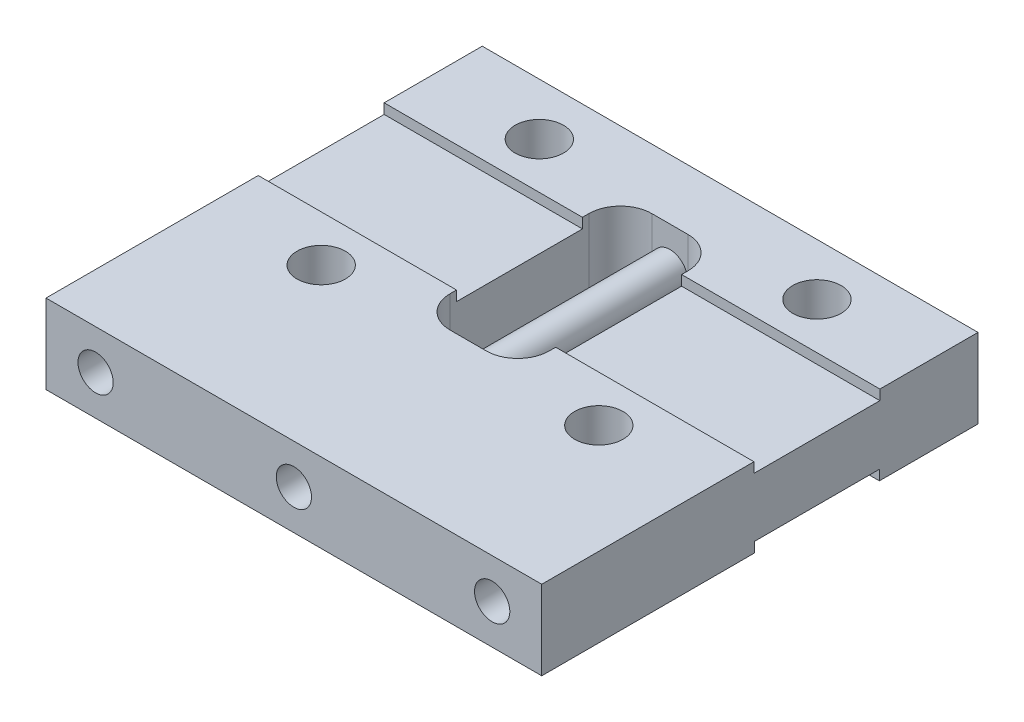
ISO-10303-21;
HEADER;
FILE_DESCRIPTION(('STEP AP214'),'2;1');
FILE_NAME('part.step','',(''),(''),'','','');
FILE_SCHEMA(('AUTOMOTIVE_DESIGN { 1 0 10303 214 1 1 1 1 }'));
ENDSEC;
DATA;
#1=APPLICATION_CONTEXT('core data for automotive mechanical design processes');
#2=APPLICATION_PROTOCOL_DEFINITION('international standard','automotive_design',2000,#1);
#3=PRODUCT_CONTEXT('',#1,'mechanical');
#4=PRODUCT('Part','Part','',(#3));
#5=PRODUCT_RELATED_PRODUCT_CATEGORY('part','',(#4));
#6=PRODUCT_DEFINITION_FORMATION('','',#4);
#7=PRODUCT_DEFINITION_CONTEXT('part definition',#1,'design');
#8=PRODUCT_DEFINITION('design','',#6,#7);
#9=PRODUCT_DEFINITION_SHAPE('','',#8);
#10=(LENGTH_UNIT() NAMED_UNIT(*) SI_UNIT(.MILLI.,.METRE.));
#11=(NAMED_UNIT(*) PLANE_ANGLE_UNIT() SI_UNIT($,.RADIAN.));
#12=(NAMED_UNIT(*) SI_UNIT($,.STERADIAN.) SOLID_ANGLE_UNIT());
#13=UNCERTAINTY_MEASURE_WITH_UNIT(LENGTH_MEASURE(1.E-05),#10,'distance_accuracy_value','');
#14=(GEOMETRIC_REPRESENTATION_CONTEXT(3) GLOBAL_UNCERTAINTY_ASSIGNED_CONTEXT((#13)) GLOBAL_UNIT_ASSIGNED_CONTEXT((#10,
#11,#12)) REPRESENTATION_CONTEXT('',''));
#15=CARTESIAN_POINT('',(0.,0.,0.));
#16=DIRECTION('',(0.,0.,1.));
#17=DIRECTION('',(1.,0.,0.));
#18=AXIS2_PLACEMENT_3D('',#15,#16,#17);
#19=CARTESIAN_POINT('',(22.5,2.,0.));
#20=DIRECTION('',(0.,0.,-1.));
#21=DIRECTION('',(-1.,0.,0.));
#22=AXIS2_PLACEMENT_3D('',#19,#20,#21);
#23=CYLINDRICAL_SURFACE('',#22,0.888999999999985);
#24=CARTESIAN_POINT('',(22.5,2.,22.));
#25=DIRECTION('',(0.,0.,-1.));
#26=DIRECTION('',(-1.,0.,0.));
#27=AXIS2_PLACEMENT_3D('',#24,#25,#26);
#28=CIRCLE('',#27,0.888999999999984);
#29=CARTESIAN_POINT('',(21.611,2.,22.));
#30=VERTEX_POINT('',#29);
#31=EDGE_CURVE('E651',#30,#30,#28,.T.);
#32=ORIENTED_EDGE('',*,*,#31,.F.);
#33=EDGE_LOOP('',(#32));
#34=FACE_BOUND('',#33,.T.);
#35=CARTESIAN_POINT('',(22.5,2.,16.));
#36=DIRECTION('',(0.,0.,-1.));
#37=DIRECTION('',(-1.,0.,0.));
#38=AXIS2_PLACEMENT_3D('',#35,#36,#37);
#39=CIRCLE('',#38,0.888999999999985);
#40=CARTESIAN_POINT('',(21.611,2.,16.));
#41=VERTEX_POINT('',#40);
#42=EDGE_CURVE('E11',#41,#41,#39,.F.);
#43=ORIENTED_EDGE('',*,*,#42,.F.);
#44=EDGE_LOOP('',(#43));
#45=FACE_BOUND('',#44,.T.);
#46=ADVANCED_FACE('F33',(#34,#45),#23,.F.);
#47=CARTESIAN_POINT('',(12.5,2.,22.));
#48=DIRECTION('',(0.,0.,1.));
#49=DIRECTION('',(1.,0.,0.));
#50=AXIS2_PLACEMENT_3D('',#47,#48,#49);
#51=CYLINDRICAL_SURFACE('',#50,0.888999999999987);
#52=CARTESIAN_POINT('',(12.5,2.,22.));
#53=DIRECTION('',(0.,0.,1.));
#54=DIRECTION('',(1.,0.,0.));
#55=AXIS2_PLACEMENT_3D('',#52,#53,#54);
#56=CIRCLE('',#55,0.888999999999989);
#57=CARTESIAN_POINT('',(13.389,2.,22.));
#58=VERTEX_POINT('',#57);
#59=EDGE_CURVE('E657',#58,#58,#56,.T.);
#60=ORIENTED_EDGE('',*,*,#59,.T.);
#61=EDGE_LOOP('',(#60));
#62=FACE_BOUND('',#61,.T.);
#63=CARTESIAN_POINT('',(12.5,2.,16.));
#64=DIRECTION('',(0.,0.,-1.));
#65=DIRECTION('',(-1.,0.,0.));
#66=AXIS2_PLACEMENT_3D('',#63,#64,#65);
#67=CIRCLE('',#66,0.888999999999987);
#68=CARTESIAN_POINT('',(11.611,2.,16.));
#69=VERTEX_POINT('',#68);
#70=EDGE_CURVE('E41',#69,#69,#67,.F.);
#71=ORIENTED_EDGE('',*,*,#70,.F.);
#72=EDGE_LOOP('',(#71));
#73=FACE_BOUND('',#72,.T.);
#74=ADVANCED_FACE('F324',(#62,#73),#51,.F.);
#75=CARTESIAN_POINT('',(2.5,2.,0.));
#76=DIRECTION('',(0.,0.,-1.));
#77=DIRECTION('',(-1.,0.,0.));
#78=AXIS2_PLACEMENT_3D('',#75,#76,#77);
#79=CYLINDRICAL_SURFACE('',#78,0.888999999999986);
#80=CARTESIAN_POINT('',(2.5,2.,22.));
#81=DIRECTION('',(0.,0.,-1.));
#82=DIRECTION('',(-1.,0.,0.));
#83=AXIS2_PLACEMENT_3D('',#80,#81,#82);
#84=CIRCLE('',#83,0.888999999999985);
#85=CARTESIAN_POINT('',(1.61100000000002,2.,22.));
#86=VERTEX_POINT('',#85);
#87=EDGE_CURVE('E654',#86,#86,#84,.T.);
#88=ORIENTED_EDGE('',*,*,#87,.F.);
#89=EDGE_LOOP('',(#88));
#90=FACE_BOUND('',#89,.T.);
#91=CARTESIAN_POINT('',(2.5,2.,16.));
#92=DIRECTION('',(0.,0.,-1.));
#93=DIRECTION('',(-1.,0.,0.));
#94=AXIS2_PLACEMENT_3D('',#91,#92,#93);
#95=CIRCLE('',#94,0.888999999999986);
#96=CARTESIAN_POINT('',(1.61100000000001,2.,16.));
#97=VERTEX_POINT('',#96);
#98=EDGE_CURVE('E317',#97,#97,#95,.F.);
#99=ORIENTED_EDGE('',*,*,#98,.F.);
#100=EDGE_LOOP('',(#99));
#101=FACE_BOUND('',#100,.T.);
#102=ADVANCED_FACE('F326',(#90,#101),#79,.F.);
#103=CARTESIAN_POINT('',(0.,4.,0.));
#104=DIRECTION('',(0.,-1.,0.));
#105=DIRECTION('',(0.,0.,-1.));
#106=AXIS2_PLACEMENT_3D('',#103,#104,#105);
#107=PLANE('',#106);
#108=CARTESIAN_POINT('',(19.5,4.,2.6225));
#109=DIRECTION('',(0.,-1.,0.));
#110=DIRECTION('',(0.,0.,-1.));
#111=AXIS2_PLACEMENT_3D('',#108,#109,#110);
#112=CIRCLE('',#111,1.21919999999999);
#113=CARTESIAN_POINT('',(19.5,4.,1.40330000000001));
#114=VERTEX_POINT('',#113);
#115=EDGE_CURVE('E639',#114,#114,#112,.T.);
#116=ORIENTED_EDGE('',*,*,#115,.T.);
#117=EDGE_LOOP('',(#116));
#118=FACE_BOUND('',#117,.T.);
#119=CARTESIAN_POINT('',(5.5,4.,2.6225));
#120=DIRECTION('',(0.,-1.,0.));
#121=DIRECTION('',(0.,0.,-1.));
#122=AXIS2_PLACEMENT_3D('',#119,#120,#121);
#123=CIRCLE('',#122,1.21919999999999);
#124=CARTESIAN_POINT('',(5.5,4.,1.40330000000001));
#125=VERTEX_POINT('',#124);
#126=EDGE_CURVE('E633',#125,#125,#123,.T.);
#127=ORIENTED_EDGE('',*,*,#126,.T.);
#128=EDGE_LOOP('',(#127));
#129=FACE_BOUND('',#128,.T.);
#130=DIRECTION('',(1.,0.,0.));
#131=VECTOR('',#130,1.);
#132=CARTESIAN_POINT('',(10.,4.,3.035));
#133=LINE('',#132,#131);
#134=CARTESIAN_POINT('',(11.5875,4.,3.035));
#135=VERTEX_POINT('',#134);
#136=CARTESIAN_POINT('',(13.4125,4.,3.035));
#137=VERTEX_POINT('',#136);
#138=EDGE_CURVE('E463',#135,#137,#133,.T.);
#139=ORIENTED_EDGE('',*,*,#138,.T.);
#140=CARTESIAN_POINT('',(13.4125,4.,4.6225));
#141=DIRECTION('',(0.,-1.,0.));
#142=DIRECTION('',(0.,0.,-1.));
#143=AXIS2_PLACEMENT_3D('',#140,#141,#142);
#144=CIRCLE('',#143,1.5875);
#145=CARTESIAN_POINT('',(15.,4.,4.6225));
#146=VERTEX_POINT('',#145);
#147=EDGE_CURVE('E312',#137,#146,#144,.T.);
#148=ORIENTED_EDGE('',*,*,#147,.T.);
#149=DIRECTION('',(0.,0.,1.));
#150=VECTOR('',#149,1.);
#151=CARTESIAN_POINT('',(15.,4.,3.035));
#152=LINE('',#151,#150);
#153=CARTESIAN_POINT('',(15.,4.,4.9475));
#154=VERTEX_POINT('',#153);
#155=EDGE_CURVE('E461',#146,#154,#152,.T.);
#156=ORIENTED_EDGE('',*,*,#155,.T.);
#157=DIRECTION('',(1.,0.,0.));
#158=VECTOR('',#157,1.);
#159=CARTESIAN_POINT('',(0.,4.,4.9475));
#160=LINE('',#159,#158);
#161=CARTESIAN_POINT('',(25.,4.,4.9475));
#162=VERTEX_POINT('',#161);
#163=EDGE_CURVE('E499',#154,#162,#160,.T.);
#164=ORIENTED_EDGE('',*,*,#163,.T.);
#165=DIRECTION('',(0.,0.,1.));
#166=VECTOR('',#165,1.);
#167=CARTESIAN_POINT('',(25.,4.,0.));
#168=LINE('',#167,#166);
#169=CARTESIAN_POINT('',(25.,4.,0.));
#170=VERTEX_POINT('',#169);
#171=EDGE_CURVE('E249',#170,#162,#168,.T.);
#172=ORIENTED_EDGE('',*,*,#171,.F.);
#173=DIRECTION('',(1.,0.,0.));
#174=VECTOR('',#173,1.);
#175=CARTESIAN_POINT('',(0.,4.,0.));
#176=LINE('',#175,#174);
#177=CARTESIAN_POINT('',(0.,4.,0.));
#178=VERTEX_POINT('',#177);
#179=EDGE_CURVE('E250',#178,#170,#176,.T.);
#180=ORIENTED_EDGE('',*,*,#179,.F.);
#181=DIRECTION('',(0.,0.,-1.));
#182=VECTOR('',#181,1.);
#183=CARTESIAN_POINT('',(0.,4.,22.));
#184=LINE('',#183,#182);
#185=CARTESIAN_POINT('',(0.,4.,4.9475));
#186=VERTEX_POINT('',#185);
#187=EDGE_CURVE('E274',#186,#178,#184,.T.);
#188=ORIENTED_EDGE('',*,*,#187,.F.);
#189=DIRECTION('',(1.,0.,0.));
#190=VECTOR('',#189,1.);
#191=CARTESIAN_POINT('',(0.,4.,4.9475));
#192=LINE('',#191,#190);
#193=CARTESIAN_POINT('',(10.,4.,4.9475));
#194=VERTEX_POINT('',#193);
#195=EDGE_CURVE('E569',#186,#194,#192,.T.);
#196=ORIENTED_EDGE('',*,*,#195,.T.);
#197=DIRECTION('',(0.,0.,-1.));
#198=VECTOR('',#197,1.);
#199=CARTESIAN_POINT('',(10.,4.,13.21));
#200=LINE('',#199,#198);
#201=CARTESIAN_POINT('',(10.,4.,4.6225));
#202=VERTEX_POINT('',#201);
#203=EDGE_CURVE('E563',#194,#202,#200,.T.);
#204=ORIENTED_EDGE('',*,*,#203,.T.);
#205=CARTESIAN_POINT('',(11.5875,4.,4.6225));
#206=DIRECTION('',(0.,-1.,0.));
#207=DIRECTION('',(0.,0.,-1.));
#208=AXIS2_PLACEMENT_3D('',#205,#206,#207);
#209=CIRCLE('',#208,1.5875);
#210=EDGE_CURVE('E55',#202,#135,#209,.T.);
#211=ORIENTED_EDGE('',*,*,#210,.T.);
#212=EDGE_LOOP('',(#139,#148,#156,#164,#172,#180,#188,#196,#204,#211));
#213=FACE_BOUND('',#212,.T.);
#214=ADVANCED_FACE('F333',(#118,#129,#213),#107,.F.);
#215=CARTESIAN_POINT('',(0.,0.,0.));
#216=DIRECTION('',(0.,-1.,0.));
#217=DIRECTION('',(0.,0.,-1.));
#218=AXIS2_PLACEMENT_3D('',#215,#216,#217);
#219=PLANE('',#218);
#220=CARTESIAN_POINT('',(19.5,0.,13.6225));
#221=DIRECTION('',(0.,-1.,0.));
#222=DIRECTION('',(0.,0.,-1.));
#223=AXIS2_PLACEMENT_3D('',#220,#221,#222);
#224=CIRCLE('',#223,1.21919999999999);
#225=CARTESIAN_POINT('',(19.5,0.,12.4033));
#226=VERTEX_POINT('',#225);
#227=EDGE_CURVE('E648',#226,#226,#224,.T.);
#228=ORIENTED_EDGE('',*,*,#227,.F.);
#229=EDGE_LOOP('',(#228));
#230=FACE_BOUND('',#229,.T.);
#231=CARTESIAN_POINT('',(5.5,0.,13.6225));
#232=DIRECTION('',(0.,-1.,0.));
#233=DIRECTION('',(0.,0.,-1.));
#234=AXIS2_PLACEMENT_3D('',#231,#232,#233);
#235=CIRCLE('',#234,1.21919999999999);
#236=CARTESIAN_POINT('',(5.5,0.,12.4033));
#237=VERTEX_POINT('',#236);
#238=EDGE_CURVE('E630',#237,#237,#235,.T.);
#239=ORIENTED_EDGE('',*,*,#238,.F.);
#240=EDGE_LOOP('',(#239));
#241=FACE_BOUND('',#240,.T.);
#242=DIRECTION('',(1.,0.,0.));
#243=VECTOR('',#242,1.);
#244=CARTESIAN_POINT('',(0.,0.,11.2725));
#245=LINE('',#244,#243);
#246=CARTESIAN_POINT('',(0.,0.,11.2725));
#247=VERTEX_POINT('',#246);
#248=CARTESIAN_POINT('',(10.,0.,11.2725));
#249=VERTEX_POINT('',#248);
#250=EDGE_CURVE('E518',#247,#249,#245,.T.);
#251=ORIENTED_EDGE('',*,*,#250,.T.);
#252=DIRECTION('',(0.,0.,-1.));
#253=VECTOR('',#252,1.);
#254=CARTESIAN_POINT('',(10.,0.,13.21));
#255=LINE('',#254,#253);
#256=CARTESIAN_POINT('',(10.,0.,11.6225));
#257=VERTEX_POINT('',#256);
#258=EDGE_CURVE('E479',#257,#249,#255,.T.);
#259=ORIENTED_EDGE('',*,*,#258,.F.);
#260=CARTESIAN_POINT('',(11.5875,0.,11.6225));
#261=DIRECTION('',(0.,-1.,0.));
#262=DIRECTION('',(0.,0.,-1.));
#263=AXIS2_PLACEMENT_3D('',#260,#261,#262);
#264=CIRCLE('',#263,1.5875);
#265=CARTESIAN_POINT('',(11.5875,0.,13.21));
#266=VERTEX_POINT('',#265);
#267=EDGE_CURVE('E306',#257,#266,#264,.F.);
#268=ORIENTED_EDGE('',*,*,#267,.T.);
#269=DIRECTION('',(-1.,0.,0.));
#270=VECTOR('',#269,1.);
#271=CARTESIAN_POINT('',(15.,0.,13.21));
#272=LINE('',#271,#270);
#273=CARTESIAN_POINT('',(13.4125,0.,13.21));
#274=VERTEX_POINT('',#273);
#275=EDGE_CURVE('E474',#274,#266,#272,.T.);
#276=ORIENTED_EDGE('',*,*,#275,.F.);
#277=CARTESIAN_POINT('',(13.4125,0.,11.6225));
#278=DIRECTION('',(0.,-1.,0.));
#279=DIRECTION('',(0.,0.,-1.));
#280=AXIS2_PLACEMENT_3D('',#277,#278,#279);
#281=CIRCLE('',#280,1.5875);
#282=CARTESIAN_POINT('',(15.,0.,11.6225));
#283=VERTEX_POINT('',#282);
#284=EDGE_CURVE('E302',#274,#283,#281,.F.);
#285=ORIENTED_EDGE('',*,*,#284,.T.);
#286=DIRECTION('',(0.,0.,1.));
#287=VECTOR('',#286,1.);
#288=CARTESIAN_POINT('',(15.,0.,3.035));
#289=LINE('',#288,#287);
#290=CARTESIAN_POINT('',(15.,0.,11.2725));
#291=VERTEX_POINT('',#290);
#292=EDGE_CURVE('E483',#291,#283,#289,.T.);
#293=ORIENTED_EDGE('',*,*,#292,.F.);
#294=DIRECTION('',(1.,0.,0.));
#295=VECTOR('',#294,1.);
#296=CARTESIAN_POINT('',(-0.001000000000001,0.,11.2725));
#297=LINE('',#296,#295);
#298=CARTESIAN_POINT('',(25.,0.,11.2725));
#299=VERTEX_POINT('',#298);
#300=EDGE_CURVE('E554',#291,#299,#297,.T.);
#301=ORIENTED_EDGE('',*,*,#300,.T.);
#302=DIRECTION('',(0.,0.,1.));
#303=VECTOR('',#302,1.);
#304=CARTESIAN_POINT('',(25.,0.,0.));
#305=LINE('',#304,#303);
#306=CARTESIAN_POINT('',(25.,0.,22.));
#307=VERTEX_POINT('',#306);
#308=EDGE_CURVE('E267',#299,#307,#305,.T.);
#309=ORIENTED_EDGE('',*,*,#308,.T.);
#310=DIRECTION('',(-1.,0.,0.));
#311=VECTOR('',#310,1.);
#312=CARTESIAN_POINT('',(25.,0.,22.));
#313=LINE('',#312,#311);
#314=CARTESIAN_POINT('',(0.,0.,22.));
#315=VERTEX_POINT('',#314);
#316=EDGE_CURVE('E271',#307,#315,#313,.T.);
#317=ORIENTED_EDGE('',*,*,#316,.T.);
#318=DIRECTION('',(0.,0.,-1.));
#319=VECTOR('',#318,1.);
#320=CARTESIAN_POINT('',(0.,0.,22.));
#321=LINE('',#320,#319);
#322=EDGE_CURVE('E260',#315,#247,#321,.T.);
#323=ORIENTED_EDGE('',*,*,#322,.T.);
#324=EDGE_LOOP('',(#251,#259,#268,#276,#285,#293,#301,#309,#317,#323));
#325=FACE_BOUND('',#324,.T.);
#326=ADVANCED_FACE('F430',(#230,#241,#325),#219,.T.);
#327=CARTESIAN_POINT('',(0.,4.,22.));
#328=DIRECTION('',(-1.,0.,0.));
#329=DIRECTION('',(0.,0.,1.));
#330=AXIS2_PLACEMENT_3D('',#327,#328,#329);
#331=PLANE('',#330);
#332=DIRECTION('',(0.,1.,0.));
#333=VECTOR('',#332,1.);
#334=CARTESIAN_POINT('',(0.,3.492,4.9475));
#335=LINE('',#334,#333);
#336=CARTESIAN_POINT('',(0.,3.492,4.9475));
#337=VERTEX_POINT('',#336);
#338=EDGE_CURVE('E495',#337,#186,#335,.T.);
#339=ORIENTED_EDGE('',*,*,#338,.T.);
#340=ORIENTED_EDGE('',*,*,#187,.T.);
#341=DIRECTION('',(0.,-1.,0.));
#342=VECTOR('',#341,1.);
#343=CARTESIAN_POINT('',(0.,4.,0.));
#344=LINE('',#343,#342);
#345=CARTESIAN_POINT('',(0.,0.,0.));
#346=VERTEX_POINT('',#345);
#347=EDGE_CURVE('E259',#178,#346,#344,.T.);
#348=ORIENTED_EDGE('',*,*,#347,.T.);
#349=CARTESIAN_POINT('',(0.,0.,4.9725));
#350=VERTEX_POINT('',#349);
#351=EDGE_CURVE('E264',#350,#346,#321,.T.);
#352=ORIENTED_EDGE('',*,*,#351,.F.);
#353=DIRECTION('',(0.,1.,0.));
#354=VECTOR('',#353,1.);
#355=CARTESIAN_POINT('',(0.,0.,4.9725));
#356=LINE('',#355,#354);
#357=CARTESIAN_POINT('',(0.,0.508,4.9725));
#358=VERTEX_POINT('',#357);
#359=EDGE_CURVE('E512',#350,#358,#356,.T.);
#360=ORIENTED_EDGE('',*,*,#359,.T.);
#361=DIRECTION('',(0.,0.,1.));
#362=VECTOR('',#361,1.);
#363=CARTESIAN_POINT('',(0.,0.508,4.9725));
#364=LINE('',#363,#362);
#365=CARTESIAN_POINT('',(0.,0.508,11.2725));
#366=VERTEX_POINT('',#365);
#367=EDGE_CURVE('E515',#358,#366,#364,.T.);
#368=ORIENTED_EDGE('',*,*,#367,.T.);
#369=DIRECTION('',(0.,-1.,0.));
#370=VECTOR('',#369,1.);
#371=CARTESIAN_POINT('',(0.,0.508,11.2725));
#372=LINE('',#371,#370);
#373=EDGE_CURVE('E516',#366,#247,#372,.T.);
#374=ORIENTED_EDGE('',*,*,#373,.T.);
#375=ORIENTED_EDGE('',*,*,#322,.F.);
#376=DIRECTION('',(0.,-1.,0.));
#377=VECTOR('',#376,1.);
#378=CARTESIAN_POINT('',(0.,4.,22.));
#379=LINE('',#378,#377);
#380=CARTESIAN_POINT('',(0.,4.,22.));
#381=VERTEX_POINT('',#380);
#382=EDGE_CURVE('E275',#381,#315,#379,.T.);
#383=ORIENTED_EDGE('',*,*,#382,.F.);
#384=CARTESIAN_POINT('',(0.,4.,11.2975));
#385=VERTEX_POINT('',#384);
#386=EDGE_CURVE('E254',#381,#385,#184,.T.);
#387=ORIENTED_EDGE('',*,*,#386,.T.);
#388=DIRECTION('',(0.,-1.,0.));
#389=VECTOR('',#388,1.);
#390=CARTESIAN_POINT('',(0.,4.,11.2975));
#391=LINE('',#390,#389);
#392=CARTESIAN_POINT('',(0.,3.492,11.2975));
#393=VERTEX_POINT('',#392);
#394=EDGE_CURVE('E615',#385,#393,#391,.T.);
#395=ORIENTED_EDGE('',*,*,#394,.T.);
#396=DIRECTION('',(0.,0.,-1.));
#397=VECTOR('',#396,1.);
#398=CARTESIAN_POINT('',(0.,3.492,11.2975));
#399=LINE('',#398,#397);
#400=EDGE_CURVE('E604',#393,#337,#399,.T.);
#401=ORIENTED_EDGE('',*,*,#400,.T.);
#402=EDGE_LOOP('',(#339,#340,#348,#352,#360,#368,#374,#375,#383,#387,#395,#401));
#403=FACE_BOUND('',#402,.T.);
#404=ADVANCED_FACE('F434',(#403),#331,.T.);
#405=CARTESIAN_POINT('',(25.,4.,22.));
#406=DIRECTION('',(0.,0.,1.));
#407=DIRECTION('',(1.,0.,0.));
#408=AXIS2_PLACEMENT_3D('',#405,#406,#407);
#409=PLANE('',#408);
#410=ORIENTED_EDGE('',*,*,#59,.F.);
#411=EDGE_LOOP('',(#410));
#412=FACE_BOUND('',#411,.T.);
#413=ORIENTED_EDGE('',*,*,#87,.T.);
#414=EDGE_LOOP('',(#413));
#415=FACE_BOUND('',#414,.T.);
#416=ORIENTED_EDGE('',*,*,#31,.T.);
#417=EDGE_LOOP('',(#416));
#418=FACE_BOUND('',#417,.T.);
#419=ORIENTED_EDGE('',*,*,#316,.F.);
#420=DIRECTION('',(0.,-1.,0.));
#421=VECTOR('',#420,1.);
#422=CARTESIAN_POINT('',(25.,4.,22.));
#423=LINE('',#422,#421);
#424=CARTESIAN_POINT('',(25.,4.,22.));
#425=VERTEX_POINT('',#424);
#426=EDGE_CURVE('E278',#425,#307,#423,.T.);
#427=ORIENTED_EDGE('',*,*,#426,.F.);
#428=DIRECTION('',(-1.,0.,0.));
#429=VECTOR('',#428,1.);
#430=CARTESIAN_POINT('',(25.,4.,22.));
#431=LINE('',#430,#429);
#432=EDGE_CURVE('E248',#425,#381,#431,.T.);
#433=ORIENTED_EDGE('',*,*,#432,.T.);
#434=ORIENTED_EDGE('',*,*,#382,.T.);
#435=EDGE_LOOP('',(#419,#427,#433,#434));
#436=FACE_BOUND('',#435,.T.);
#437=ADVANCED_FACE('F431',(#412,#415,#418,#436),#409,.T.);
#438=CARTESIAN_POINT('',(25.,4.,0.));
#439=DIRECTION('',(1.,0.,0.));
#440=DIRECTION('',(0.,0.,-1.));
#441=AXIS2_PLACEMENT_3D('',#438,#439,#440);
#442=PLANE('',#441);
#443=DIRECTION('',(0.,1.,0.));
#444=VECTOR('',#443,1.);
#445=CARTESIAN_POINT('',(25.,3.492,4.9475));
#446=LINE('',#445,#444);
#447=CARTESIAN_POINT('',(25.,3.492,4.9475));
#448=VERTEX_POINT('',#447);
#449=EDGE_CURVE('E232',#448,#162,#446,.T.);
#450=ORIENTED_EDGE('',*,*,#449,.F.);
#451=DIRECTION('',(0.,0.,-1.));
#452=VECTOR('',#451,1.);
#453=CARTESIAN_POINT('',(25.,3.492,11.2975));
#454=LINE('',#453,#452);
#455=CARTESIAN_POINT('',(25.,3.492,11.2975));
#456=VERTEX_POINT('',#455);
#457=EDGE_CURVE('E241',#456,#448,#454,.T.);
#458=ORIENTED_EDGE('',*,*,#457,.F.);
#459=DIRECTION('',(0.,-1.,0.));
#460=VECTOR('',#459,1.);
#461=CARTESIAN_POINT('',(25.,4.,11.2975));
#462=LINE('',#461,#460);
#463=CARTESIAN_POINT('',(25.,4.,11.2975));
#464=VERTEX_POINT('',#463);
#465=EDGE_CURVE('E223',#464,#456,#462,.T.);
#466=ORIENTED_EDGE('',*,*,#465,.F.);
#467=EDGE_CURVE('E238',#464,#425,#168,.T.);
#468=ORIENTED_EDGE('',*,*,#467,.T.);
#469=ORIENTED_EDGE('',*,*,#426,.T.);
#470=ORIENTED_EDGE('',*,*,#308,.F.);
#471=DIRECTION('',(0.,-1.,0.));
#472=VECTOR('',#471,1.);
#473=CARTESIAN_POINT('',(25.,0.508,11.2725));
#474=LINE('',#473,#472);
#475=CARTESIAN_POINT('',(25.,0.508,11.2725));
#476=VERTEX_POINT('',#475);
#477=EDGE_CURVE('E548',#476,#299,#474,.T.);
#478=ORIENTED_EDGE('',*,*,#477,.F.);
#479=DIRECTION('',(0.,0.,1.));
#480=VECTOR('',#479,1.);
#481=CARTESIAN_POINT('',(25.,0.508,4.9725));
#482=LINE('',#481,#480);
#483=CARTESIAN_POINT('',(25.,0.508,4.9725));
#484=VERTEX_POINT('',#483);
#485=EDGE_CURVE('E551',#484,#476,#482,.T.);
#486=ORIENTED_EDGE('',*,*,#485,.F.);
#487=DIRECTION('',(0.,1.,0.));
#488=VECTOR('',#487,1.);
#489=CARTESIAN_POINT('',(25.,0.,4.9725));
#490=LINE('',#489,#488);
#491=CARTESIAN_POINT('',(25.,0.,4.9725));
#492=VERTEX_POINT('',#491);
#493=EDGE_CURVE('E504',#492,#484,#490,.T.);
#494=ORIENTED_EDGE('',*,*,#493,.F.);
#495=CARTESIAN_POINT('',(25.,0.,0.));
#496=VERTEX_POINT('',#495);
#497=EDGE_CURVE('E268',#496,#492,#305,.T.);
#498=ORIENTED_EDGE('',*,*,#497,.F.);
#499=DIRECTION('',(0.,-1.,0.));
#500=VECTOR('',#499,1.);
#501=CARTESIAN_POINT('',(25.,4.,0.));
#502=LINE('',#501,#500);
#503=EDGE_CURVE('E280',#170,#496,#502,.T.);
#504=ORIENTED_EDGE('',*,*,#503,.F.);
#505=ORIENTED_EDGE('',*,*,#171,.T.);
#506=EDGE_LOOP('',(#450,#458,#466,#468,#469,#470,#478,#486,#494,#498,#504,#505));
#507=FACE_BOUND('',#506,.T.);
#508=ADVANCED_FACE('F236',(#507),#442,.T.);
#509=CARTESIAN_POINT('',(0.,4.,0.));
#510=DIRECTION('',(0.,0.,-1.));
#511=DIRECTION('',(-1.,0.,0.));
#512=AXIS2_PLACEMENT_3D('',#509,#510,#511);
#513=PLANE('',#512);
#514=DIRECTION('',(1.,0.,0.));
#515=VECTOR('',#514,1.);
#516=CARTESIAN_POINT('',(0.,0.,0.));
#517=LINE('',#516,#515);
#518=EDGE_CURVE('E263',#346,#496,#517,.T.);
#519=ORIENTED_EDGE('',*,*,#518,.F.);
#520=ORIENTED_EDGE('',*,*,#347,.F.);
#521=ORIENTED_EDGE('',*,*,#179,.T.);
#522=ORIENTED_EDGE('',*,*,#503,.T.);
#523=EDGE_LOOP('',(#519,#520,#521,#522));
#524=FACE_BOUND('',#523,.T.);
#525=ADVANCED_FACE('F425',(#524),#513,.T.);
#526=CARTESIAN_POINT('',(19.5,4.,13.6225));
#527=DIRECTION('',(0.,-1.,0.));
#528=DIRECTION('',(0.,0.,-1.));
#529=AXIS2_PLACEMENT_3D('',#526,#527,#528);
#530=CIRCLE('',#529,1.21919999999999);
#531=CARTESIAN_POINT('',(19.5,4.,12.4033));
#532=VERTEX_POINT('',#531);
#533=EDGE_CURVE('E645',#532,#532,#530,.T.);
#534=ORIENTED_EDGE('',*,*,#533,.T.);
#535=EDGE_LOOP('',(#534));
#536=FACE_BOUND('',#535,.T.);
#537=CARTESIAN_POINT('',(5.5,4.,13.6225));
#538=DIRECTION('',(0.,-1.,0.));
#539=DIRECTION('',(0.,0.,-1.));
#540=AXIS2_PLACEMENT_3D('',#537,#538,#539);
#541=CIRCLE('',#540,1.21919999999999);
#542=CARTESIAN_POINT('',(5.5,4.,12.4033));
#543=VERTEX_POINT('',#542);
#544=EDGE_CURVE('E242',#543,#543,#541,.T.);
#545=ORIENTED_EDGE('',*,*,#544,.T.);
#546=EDGE_LOOP('',(#545));
#547=FACE_BOUND('',#546,.T.);
#548=ORIENTED_EDGE('',*,*,#467,.F.);
#549=DIRECTION('',(1.,0.,0.));
#550=VECTOR('',#549,1.);
#551=CARTESIAN_POINT('',(0.,4.,11.2975));
#552=LINE('',#551,#550);
#553=CARTESIAN_POINT('',(15.,4.,11.2975));
#554=VERTEX_POINT('',#553);
#555=EDGE_CURVE('E220',#554,#464,#552,.T.);
#556=ORIENTED_EDGE('',*,*,#555,.F.);
#557=CARTESIAN_POINT('',(15.,4.,11.6225));
#558=VERTEX_POINT('',#557);
#559=EDGE_CURVE('E469',#554,#558,#152,.T.);
#560=ORIENTED_EDGE('',*,*,#559,.T.);
#561=CARTESIAN_POINT('',(13.4125,4.,11.6225));
#562=DIRECTION('',(0.,-1.,0.));
#563=DIRECTION('',(0.,0.,-1.));
#564=AXIS2_PLACEMENT_3D('',#561,#562,#563);
#565=CIRCLE('',#564,1.5875);
#566=CARTESIAN_POINT('',(13.4125,4.,13.21));
#567=VERTEX_POINT('',#566);
#568=EDGE_CURVE('E304',#558,#567,#565,.T.);
#569=ORIENTED_EDGE('',*,*,#568,.T.);
#570=DIRECTION('',(-1.,0.,0.));
#571=VECTOR('',#570,1.);
#572=CARTESIAN_POINT('',(15.,4.,13.21));
#573=LINE('',#572,#571);
#574=CARTESIAN_POINT('',(11.5875,4.,13.21));
#575=VERTEX_POINT('',#574);
#576=EDGE_CURVE('E485',#567,#575,#573,.T.);
#577=ORIENTED_EDGE('',*,*,#576,.T.);
#578=CARTESIAN_POINT('',(11.5875,4.,11.6225));
#579=DIRECTION('',(0.,-1.,0.));
#580=DIRECTION('',(0.,0.,-1.));
#581=AXIS2_PLACEMENT_3D('',#578,#579,#580);
#582=CIRCLE('',#581,1.5875);
#583=CARTESIAN_POINT('',(10.,4.,11.6225));
#584=VERTEX_POINT('',#583);
#585=EDGE_CURVE('E308',#575,#584,#582,.T.);
#586=ORIENTED_EDGE('',*,*,#585,.T.);
#587=CARTESIAN_POINT('',(10.,4.,11.2975));
#588=VERTEX_POINT('',#587);
#589=EDGE_CURVE('E564',#584,#588,#200,.T.);
#590=ORIENTED_EDGE('',*,*,#589,.T.);
#591=DIRECTION('',(1.,0.,0.));
#592=VECTOR('',#591,1.);
#593=CARTESIAN_POINT('',(0.,4.,11.2975));
#594=LINE('',#593,#592);
#595=EDGE_CURVE('E599',#385,#588,#594,.T.);
#596=ORIENTED_EDGE('',*,*,#595,.F.);
#597=ORIENTED_EDGE('',*,*,#386,.F.);
#598=ORIENTED_EDGE('',*,*,#432,.F.);
#599=EDGE_LOOP('',(#548,#556,#560,#569,#577,#586,#590,#596,#597,#598));
#600=FACE_BOUND('',#599,.T.);
#601=ADVANCED_FACE('F245',(#536,#547,#600),#107,.F.);
#602=CARTESIAN_POINT('',(19.5,0.,2.6225));
#603=DIRECTION('',(0.,-1.,0.));
#604=DIRECTION('',(0.,0.,-1.));
#605=AXIS2_PLACEMENT_3D('',#602,#603,#604);
#606=CIRCLE('',#605,1.21919999999999);
#607=CARTESIAN_POINT('',(19.5,0.,1.40330000000001));
#608=VERTEX_POINT('',#607);
#609=EDGE_CURVE('E642',#608,#608,#606,.T.);
#610=ORIENTED_EDGE('',*,*,#609,.F.);
#611=EDGE_LOOP('',(#610));
#612=FACE_BOUND('',#611,.T.);
#613=CARTESIAN_POINT('',(5.5,0.,2.6225));
#614=DIRECTION('',(0.,-1.,0.));
#615=DIRECTION('',(0.,0.,-1.));
#616=AXIS2_PLACEMENT_3D('',#613,#614,#615);
#617=CIRCLE('',#616,1.21919999999999);
#618=CARTESIAN_POINT('',(5.5,0.,1.40330000000001));
#619=VERTEX_POINT('',#618);
#620=EDGE_CURVE('E636',#619,#619,#617,.T.);
#621=ORIENTED_EDGE('',*,*,#620,.F.);
#622=EDGE_LOOP('',(#621));
#623=FACE_BOUND('',#622,.T.);
#624=DIRECTION('',(1.,0.,0.));
#625=VECTOR('',#624,1.);
#626=CARTESIAN_POINT('',(0.,0.,4.9725));
#627=LINE('',#626,#625);
#628=CARTESIAN_POINT('',(10.,0.,4.9725));
#629=VERTEX_POINT('',#628);
#630=EDGE_CURVE('E509',#350,#629,#627,.T.);
#631=ORIENTED_EDGE('',*,*,#630,.F.);
#632=ORIENTED_EDGE('',*,*,#351,.T.);
#633=ORIENTED_EDGE('',*,*,#518,.T.);
#634=ORIENTED_EDGE('',*,*,#497,.T.);
#635=DIRECTION('',(1.,0.,0.));
#636=VECTOR('',#635,1.);
#637=CARTESIAN_POINT('',(-0.001000000000001,0.,4.9725));
#638=LINE('',#637,#636);
#639=CARTESIAN_POINT('',(15.,0.,4.9725));
#640=VERTEX_POINT('',#639);
#641=EDGE_CURVE('E558',#640,#492,#638,.T.);
#642=ORIENTED_EDGE('',*,*,#641,.F.);
#643=CARTESIAN_POINT('',(15.,0.,4.6225));
#644=VERTEX_POINT('',#643);
#645=EDGE_CURVE('E484',#644,#640,#289,.T.);
#646=ORIENTED_EDGE('',*,*,#645,.F.);
#647=CARTESIAN_POINT('',(13.4125,0.,4.6225));
#648=DIRECTION('',(0.,-1.,0.));
#649=DIRECTION('',(0.,0.,-1.));
#650=AXIS2_PLACEMENT_3D('',#647,#648,#649);
#651=CIRCLE('',#650,1.5875);
#652=CARTESIAN_POINT('',(13.4125,0.,3.035));
#653=VERTEX_POINT('',#652);
#654=EDGE_CURVE('E310',#644,#653,#651,.F.);
#655=ORIENTED_EDGE('',*,*,#654,.T.);
#656=DIRECTION('',(1.,0.,0.));
#657=VECTOR('',#656,1.);
#658=CARTESIAN_POINT('',(10.,0.,3.035));
#659=LINE('',#658,#657);
#660=CARTESIAN_POINT('',(11.5875,0.,3.035));
#661=VERTEX_POINT('',#660);
#662=EDGE_CURVE('E481',#661,#653,#659,.T.);
#663=ORIENTED_EDGE('',*,*,#662,.F.);
#664=CARTESIAN_POINT('',(11.5875,0.,4.6225));
#665=DIRECTION('',(0.,-1.,0.));
#666=DIRECTION('',(0.,0.,-1.));
#667=AXIS2_PLACEMENT_3D('',#664,#665,#666);
#668=CIRCLE('',#667,1.5875);
#669=CARTESIAN_POINT('',(10.,0.,4.6225));
#670=VERTEX_POINT('',#669);
#671=EDGE_CURVE('E314',#661,#670,#668,.F.);
#672=ORIENTED_EDGE('',*,*,#671,.T.);
#673=EDGE_CURVE('E477',#629,#670,#255,.T.);
#674=ORIENTED_EDGE('',*,*,#673,.F.);
#675=EDGE_LOOP('',(#631,#632,#633,#634,#642,#646,#655,#663,#672,#674));
#676=FACE_BOUND('',#675,.T.);
#677=ADVANCED_FACE('F421',(#612,#623,#676),#219,.T.);
#678=CARTESIAN_POINT('',(15.,4.,13.21));
#679=DIRECTION('',(0.,0.,1.));
#680=DIRECTION('',(1.,0.,0.));
#681=AXIS2_PLACEMENT_3D('',#678,#679,#680);
#682=PLANE('',#681);
#683=CARTESIAN_POINT('',(12.5,2.,13.21));
#684=DIRECTION('',(0.,0.,1.));
#685=DIRECTION('',(1.,0.,0.));
#686=AXIS2_PLACEMENT_3D('',#683,#684,#685);
#687=CIRCLE('',#686,0.888999999999989);
#688=CARTESIAN_POINT('',(13.389,2.,13.21));
#689=VERTEX_POINT('',#688);
#690=EDGE_CURVE('E659',#689,#689,#687,.T.);
#691=ORIENTED_EDGE('',*,*,#690,.T.);
#692=EDGE_LOOP('',(#691));
#693=FACE_BOUND('',#692,.T.);
#694=ORIENTED_EDGE('',*,*,#576,.F.);
#695=DIRECTION('',(0.,-1.,0.));
#696=VECTOR('',#695,1.);
#697=CARTESIAN_POINT('',(13.4125,0.,13.21));
#698=LINE('',#697,#696);
#699=EDGE_CURVE('E285',#567,#274,#698,.T.);
#700=ORIENTED_EDGE('',*,*,#699,.T.);
#701=ORIENTED_EDGE('',*,*,#275,.T.);
#702=DIRECTION('',(0.,-1.,0.));
#703=VECTOR('',#702,1.);
#704=CARTESIAN_POINT('',(11.5875,4.,13.21));
#705=LINE('',#704,#703);
#706=EDGE_CURVE('E277',#266,#575,#705,.F.);
#707=ORIENTED_EDGE('',*,*,#706,.T.);
#708=EDGE_LOOP('',(#694,#700,#701,#707));
#709=FACE_BOUND('',#708,.T.);
#710=ADVANCED_FACE('F411',(#693,#709),#682,.F.);
#711=CARTESIAN_POINT('',(15.,4.,3.035));
#712=DIRECTION('',(1.,0.,0.));
#713=DIRECTION('',(0.,0.,-1.));
#714=AXIS2_PLACEMENT_3D('',#711,#712,#713);
#715=PLANE('',#714);
#716=ORIENTED_EDGE('',*,*,#292,.T.);
#717=DIRECTION('',(0.,-1.,0.));
#718=VECTOR('',#717,1.);
#719=CARTESIAN_POINT('',(15.,4.,11.6225));
#720=LINE('',#719,#718);
#721=EDGE_CURVE('E291',#283,#558,#720,.F.);
#722=ORIENTED_EDGE('',*,*,#721,.T.);
#723=ORIENTED_EDGE('',*,*,#559,.F.);
#724=DIRECTION('',(0.,-1.,0.));
#725=VECTOR('',#724,1.);
#726=CARTESIAN_POINT('',(15.,4.,11.2975));
#727=LINE('',#726,#725);
#728=CARTESIAN_POINT('',(15.,3.492,11.2975));
#729=VERTEX_POINT('',#728);
#730=EDGE_CURVE('E226',#554,#729,#727,.T.);
#731=ORIENTED_EDGE('',*,*,#730,.T.);
#732=DIRECTION('',(0.,0.,-1.));
#733=VECTOR('',#732,1.);
#734=CARTESIAN_POINT('',(15.,3.492,3.035));
#735=LINE('',#734,#733);
#736=CARTESIAN_POINT('',(15.,3.492,4.9475));
#737=VERTEX_POINT('',#736);
#738=EDGE_CURVE('E620',#729,#737,#735,.T.);
#739=ORIENTED_EDGE('',*,*,#738,.T.);
#740=DIRECTION('',(0.,1.,0.));
#741=VECTOR('',#740,1.);
#742=CARTESIAN_POINT('',(15.,4.,4.9475));
#743=LINE('',#742,#741);
#744=EDGE_CURVE('E468',#737,#154,#743,.T.);
#745=ORIENTED_EDGE('',*,*,#744,.T.);
#746=ORIENTED_EDGE('',*,*,#155,.F.);
#747=DIRECTION('',(0.,-1.,0.));
#748=VECTOR('',#747,1.);
#749=CARTESIAN_POINT('',(15.,0.,4.6225));
#750=LINE('',#749,#748);
#751=EDGE_CURVE('E288',#146,#644,#750,.T.);
#752=ORIENTED_EDGE('',*,*,#751,.T.);
#753=ORIENTED_EDGE('',*,*,#645,.T.);
#754=DIRECTION('',(0.,-1.,0.));
#755=VECTOR('',#754,1.);
#756=CARTESIAN_POINT('',(15.,0.,4.9725));
#757=LINE('',#756,#755);
#758=CARTESIAN_POINT('',(15.,0.508,4.9725));
#759=VERTEX_POINT('',#758);
#760=EDGE_CURVE('E535',#759,#640,#757,.T.);
#761=ORIENTED_EDGE('',*,*,#760,.F.);
#762=DIRECTION('',(0.,0.,-1.));
#763=VECTOR('',#762,1.);
#764=CARTESIAN_POINT('',(15.,0.508,4.9725));
#765=LINE('',#764,#763);
#766=CARTESIAN_POINT('',(15.,0.508,11.2725));
#767=VERTEX_POINT('',#766);
#768=EDGE_CURVE('E543',#767,#759,#765,.T.);
#769=ORIENTED_EDGE('',*,*,#768,.F.);
#770=DIRECTION('',(0.,1.,0.));
#771=VECTOR('',#770,1.);
#772=CARTESIAN_POINT('',(15.,0.508,11.2725));
#773=LINE('',#772,#771);
#774=EDGE_CURVE('E545',#291,#767,#773,.T.);
#775=ORIENTED_EDGE('',*,*,#774,.F.);
#776=EDGE_LOOP('',(#716,#722,#723,#731,#739,#745,#746,#752,#753,#761,#769,#775));
#777=FACE_BOUND('',#776,.T.);
#778=ADVANCED_FACE('F407',(#777),#715,.F.);
#779=CARTESIAN_POINT('',(10.,4.,3.035));
#780=DIRECTION('',(0.,0.,-1.));
#781=DIRECTION('',(-1.,0.,0.));
#782=AXIS2_PLACEMENT_3D('',#779,#780,#781);
#783=PLANE('',#782);
#784=CARTESIAN_POINT('',(12.5,2.,3.035));
#785=DIRECTION('',(0.,0.,-1.));
#786=DIRECTION('',(-1.,0.,0.));
#787=AXIS2_PLACEMENT_3D('',#784,#785,#786);
#788=CIRCLE('',#787,0.888999999999989);
#789=CARTESIAN_POINT('',(11.611,2.,3.035));
#790=VERTEX_POINT('',#789);
#791=EDGE_CURVE('E662',#790,#790,#788,.T.);
#792=ORIENTED_EDGE('',*,*,#791,.T.);
#793=EDGE_LOOP('',(#792));
#794=FACE_BOUND('',#793,.T.);
#795=ORIENTED_EDGE('',*,*,#662,.T.);
#796=DIRECTION('',(0.,-1.,0.));
#797=VECTOR('',#796,1.);
#798=CARTESIAN_POINT('',(13.4125,4.,3.035));
#799=LINE('',#798,#797);
#800=EDGE_CURVE('E48',#653,#137,#799,.F.);
#801=ORIENTED_EDGE('',*,*,#800,.T.);
#802=ORIENTED_EDGE('',*,*,#138,.F.);
#803=DIRECTION('',(0.,-1.,0.));
#804=VECTOR('',#803,1.);
#805=CARTESIAN_POINT('',(11.5875,0.,3.035));
#806=LINE('',#805,#804);
#807=EDGE_CURVE('E298',#135,#661,#806,.T.);
#808=ORIENTED_EDGE('',*,*,#807,.T.);
#809=EDGE_LOOP('',(#795,#801,#802,#808));
#810=FACE_BOUND('',#809,.T.);
#811=ADVANCED_FACE('F410',(#794,#810),#783,.F.);
#812=CARTESIAN_POINT('',(10.,4.,13.21));
#813=DIRECTION('',(-1.,0.,0.));
#814=DIRECTION('',(0.,0.,1.));
#815=AXIS2_PLACEMENT_3D('',#812,#813,#814);
#816=PLANE('',#815);
#817=ORIENTED_EDGE('',*,*,#589,.F.);
#818=DIRECTION('',(0.,-1.,0.));
#819=VECTOR('',#818,1.);
#820=CARTESIAN_POINT('',(10.,0.,11.6225));
#821=LINE('',#820,#819);
#822=EDGE_CURVE('E295',#584,#257,#821,.T.);
#823=ORIENTED_EDGE('',*,*,#822,.T.);
#824=ORIENTED_EDGE('',*,*,#258,.T.);
#825=DIRECTION('',(0.,-1.,0.));
#826=VECTOR('',#825,1.);
#827=CARTESIAN_POINT('',(10.,0.508,11.2725));
#828=LINE('',#827,#826);
#829=CARTESIAN_POINT('',(10.,0.508,11.2725));
#830=VERTEX_POINT('',#829);
#831=EDGE_CURVE('E524',#830,#249,#828,.T.);
#832=ORIENTED_EDGE('',*,*,#831,.F.);
#833=DIRECTION('',(0.,0.,1.));
#834=VECTOR('',#833,1.);
#835=CARTESIAN_POINT('',(10.,0.508,4.9725));
#836=LINE('',#835,#834);
#837=CARTESIAN_POINT('',(10.,0.508,4.9725));
#838=VERTEX_POINT('',#837);
#839=EDGE_CURVE('E520',#838,#830,#836,.T.);
#840=ORIENTED_EDGE('',*,*,#839,.F.);
#841=DIRECTION('',(0.,1.,0.));
#842=VECTOR('',#841,1.);
#843=CARTESIAN_POINT('',(10.,0.,4.9725));
#844=LINE('',#843,#842);
#845=EDGE_CURVE('E527',#629,#838,#844,.T.);
#846=ORIENTED_EDGE('',*,*,#845,.F.);
#847=ORIENTED_EDGE('',*,*,#673,.T.);
#848=DIRECTION('',(0.,-1.,0.));
#849=VECTOR('',#848,1.);
#850=CARTESIAN_POINT('',(10.,4.,4.6225));
#851=LINE('',#850,#849);
#852=EDGE_CURVE('E293',#670,#202,#851,.F.);
#853=ORIENTED_EDGE('',*,*,#852,.T.);
#854=ORIENTED_EDGE('',*,*,#203,.F.);
#855=DIRECTION('',(0.,1.,0.));
#856=VECTOR('',#855,1.);
#857=CARTESIAN_POINT('',(10.,3.492,4.9475));
#858=LINE('',#857,#856);
#859=CARTESIAN_POINT('',(10.,3.492,4.9475));
#860=VERTEX_POINT('',#859);
#861=EDGE_CURVE('E612',#860,#194,#858,.T.);
#862=ORIENTED_EDGE('',*,*,#861,.F.);
#863=DIRECTION('',(0.,0.,-1.));
#864=VECTOR('',#863,1.);
#865=CARTESIAN_POINT('',(10.,3.492,11.2975));
#866=LINE('',#865,#864);
#867=CARTESIAN_POINT('',(10.,3.492,11.2975));
#868=VERTEX_POINT('',#867);
#869=EDGE_CURVE('E607',#868,#860,#866,.T.);
#870=ORIENTED_EDGE('',*,*,#869,.F.);
#871=DIRECTION('',(0.,-1.,0.));
#872=VECTOR('',#871,1.);
#873=CARTESIAN_POINT('',(10.,4.,11.2975));
#874=LINE('',#873,#872);
#875=EDGE_CURVE('E610',#588,#868,#874,.T.);
#876=ORIENTED_EDGE('',*,*,#875,.F.);
#877=EDGE_LOOP('',(#817,#823,#824,#832,#840,#846,#847,#853,#854,#862,#870,#876));
#878=FACE_BOUND('',#877,.T.);
#879=ADVANCED_FACE('F405',(#878),#816,.F.);
#880=CARTESIAN_POINT('',(-0.001000000000001,0.508,11.2725));
#881=DIRECTION('',(0.,0.,1.));
#882=DIRECTION('',(1.,0.,0.));
#883=AXIS2_PLACEMENT_3D('',#880,#881,#882);
#884=PLANE('',#883);
#885=ORIENTED_EDGE('',*,*,#774,.T.);
#886=DIRECTION('',(1.,0.,0.));
#887=VECTOR('',#886,1.);
#888=CARTESIAN_POINT('',(-0.001000000000001,0.508,11.2725));
#889=LINE('',#888,#887);
#890=EDGE_CURVE('E478',#767,#476,#889,.T.);
#891=ORIENTED_EDGE('',*,*,#890,.T.);
#892=ORIENTED_EDGE('',*,*,#477,.T.);
#893=ORIENTED_EDGE('',*,*,#300,.F.);
#894=EDGE_LOOP('',(#885,#891,#892,#893));
#895=FACE_BOUND('',#894,.T.);
#896=ADVANCED_FACE('F398',(#895),#884,.F.);
#897=CARTESIAN_POINT('',(-0.001000000000001,0.508,4.9725));
#898=DIRECTION('',(0.,1.,0.));
#899=DIRECTION('',(0.,0.,1.));
#900=AXIS2_PLACEMENT_3D('',#897,#898,#899);
#901=PLANE('',#900);
#902=ORIENTED_EDGE('',*,*,#768,.T.);
#903=DIRECTION('',(1.,0.,0.));
#904=VECTOR('',#903,1.);
#905=CARTESIAN_POINT('',(-0.001000000000001,0.508,4.9725));
#906=LINE('',#905,#904);
#907=EDGE_CURVE('E556',#759,#484,#906,.T.);
#908=ORIENTED_EDGE('',*,*,#907,.T.);
#909=ORIENTED_EDGE('',*,*,#485,.T.);
#910=ORIENTED_EDGE('',*,*,#890,.F.);
#911=EDGE_LOOP('',(#902,#908,#909,#910));
#912=FACE_BOUND('',#911,.T.);
#913=ADVANCED_FACE('F395',(#912),#901,.F.);
#914=CARTESIAN_POINT('',(-0.001000000000001,0.,4.9725));
#915=DIRECTION('',(0.,0.,-1.));
#916=DIRECTION('',(-1.,0.,0.));
#917=AXIS2_PLACEMENT_3D('',#914,#915,#916);
#918=PLANE('',#917);
#919=ORIENTED_EDGE('',*,*,#760,.T.);
#920=ORIENTED_EDGE('',*,*,#641,.T.);
#921=ORIENTED_EDGE('',*,*,#493,.T.);
#922=ORIENTED_EDGE('',*,*,#907,.F.);
#923=EDGE_LOOP('',(#919,#920,#921,#922));
#924=FACE_BOUND('',#923,.T.);
#925=ADVANCED_FACE('F393',(#924),#918,.F.);
#926=CARTESIAN_POINT('',(0.,0.508,11.2725));
#927=DIRECTION('',(0.,0.,1.));
#928=DIRECTION('',(1.,0.,0.));
#929=AXIS2_PLACEMENT_3D('',#926,#927,#928);
#930=PLANE('',#929);
#931=ORIENTED_EDGE('',*,*,#831,.T.);
#932=ORIENTED_EDGE('',*,*,#250,.F.);
#933=ORIENTED_EDGE('',*,*,#373,.F.);
#934=DIRECTION('',(1.,0.,0.));
#935=VECTOR('',#934,1.);
#936=CARTESIAN_POINT('',(0.,0.508,11.2725));
#937=LINE('',#936,#935);
#938=EDGE_CURVE('E533',#366,#830,#937,.T.);
#939=ORIENTED_EDGE('',*,*,#938,.T.);
#940=EDGE_LOOP('',(#931,#932,#933,#939));
#941=FACE_BOUND('',#940,.T.);
#942=ADVANCED_FACE('F386',(#941),#930,.F.);
#943=CARTESIAN_POINT('',(0.,0.508,4.9725));
#944=DIRECTION('',(0.,1.,0.));
#945=DIRECTION('',(0.,0.,1.));
#946=AXIS2_PLACEMENT_3D('',#943,#944,#945);
#947=PLANE('',#946);
#948=ORIENTED_EDGE('',*,*,#839,.T.);
#949=ORIENTED_EDGE('',*,*,#938,.F.);
#950=ORIENTED_EDGE('',*,*,#367,.F.);
#951=DIRECTION('',(1.,0.,0.));
#952=VECTOR('',#951,1.);
#953=CARTESIAN_POINT('',(0.,0.508,4.9725));
#954=LINE('',#953,#952);
#955=EDGE_CURVE('E536',#358,#838,#954,.T.);
#956=ORIENTED_EDGE('',*,*,#955,.T.);
#957=EDGE_LOOP('',(#948,#949,#950,#956));
#958=FACE_BOUND('',#957,.T.);
#959=ADVANCED_FACE('F383',(#958),#947,.F.);
#960=CARTESIAN_POINT('',(0.,0.,4.9725));
#961=DIRECTION('',(0.,0.,-1.));
#962=DIRECTION('',(-1.,0.,0.));
#963=AXIS2_PLACEMENT_3D('',#960,#961,#962);
#964=PLANE('',#963);
#965=ORIENTED_EDGE('',*,*,#845,.T.);
#966=ORIENTED_EDGE('',*,*,#955,.F.);
#967=ORIENTED_EDGE('',*,*,#359,.F.);
#968=ORIENTED_EDGE('',*,*,#630,.T.);
#969=EDGE_LOOP('',(#965,#966,#967,#968));
#970=FACE_BOUND('',#969,.T.);
#971=ADVANCED_FACE('F381',(#970),#964,.F.);
#972=CARTESIAN_POINT('',(0.,3.492,4.9475));
#973=DIRECTION('',(0.,0.,-1.));
#974=DIRECTION('',(-1.,0.,0.));
#975=AXIS2_PLACEMENT_3D('',#972,#973,#974);
#976=PLANE('',#975);
#977=ORIENTED_EDGE('',*,*,#861,.T.);
#978=ORIENTED_EDGE('',*,*,#195,.F.);
#979=ORIENTED_EDGE('',*,*,#338,.F.);
#980=DIRECTION('',(1.,0.,0.));
#981=VECTOR('',#980,1.);
#982=CARTESIAN_POINT('',(0.,3.492,4.9475));
#983=LINE('',#982,#981);
#984=EDGE_CURVE('E528',#337,#860,#983,.T.);
#985=ORIENTED_EDGE('',*,*,#984,.T.);
#986=EDGE_LOOP('',(#977,#978,#979,#985));
#987=FACE_BOUND('',#986,.T.);
#988=ADVANCED_FACE('F374',(#987),#976,.F.);
#989=CARTESIAN_POINT('',(0.,3.492,11.2975));
#990=DIRECTION('',(0.,-1.,0.));
#991=DIRECTION('',(0.,0.,-1.));
#992=AXIS2_PLACEMENT_3D('',#989,#990,#991);
#993=PLANE('',#992);
#994=ORIENTED_EDGE('',*,*,#869,.T.);
#995=ORIENTED_EDGE('',*,*,#984,.F.);
#996=ORIENTED_EDGE('',*,*,#400,.F.);
#997=DIRECTION('',(1.,0.,0.));
#998=VECTOR('',#997,1.);
#999=CARTESIAN_POINT('',(0.,3.492,11.2975));
#1000=LINE('',#999,#998);
#1001=EDGE_CURVE('E601',#393,#868,#1000,.T.);
#1002=ORIENTED_EDGE('',*,*,#1001,.T.);
#1003=EDGE_LOOP('',(#994,#995,#996,#1002));
#1004=FACE_BOUND('',#1003,.T.);
#1005=ADVANCED_FACE('F371',(#1004),#993,.F.);
#1006=CARTESIAN_POINT('',(0.,4.,11.2975));
#1007=DIRECTION('',(0.,0.,1.));
#1008=DIRECTION('',(1.,0.,0.));
#1009=AXIS2_PLACEMENT_3D('',#1006,#1007,#1008);
#1010=PLANE('',#1009);
#1011=ORIENTED_EDGE('',*,*,#875,.T.);
#1012=ORIENTED_EDGE('',*,*,#1001,.F.);
#1013=ORIENTED_EDGE('',*,*,#394,.F.);
#1014=ORIENTED_EDGE('',*,*,#595,.T.);
#1015=EDGE_LOOP('',(#1011,#1012,#1013,#1014));
#1016=FACE_BOUND('',#1015,.T.);
#1017=ADVANCED_FACE('F364',(#1016),#1010,.F.);
#1018=CARTESIAN_POINT('',(0.,3.492,4.9475));
#1019=DIRECTION('',(0.,0.,-1.));
#1020=DIRECTION('',(-1.,0.,0.));
#1021=AXIS2_PLACEMENT_3D('',#1018,#1019,#1020);
#1022=PLANE('',#1021);
#1023=DIRECTION('',(1.,0.,0.));
#1024=VECTOR('',#1023,1.);
#1025=CARTESIAN_POINT('',(0.,3.492,4.9475));
#1026=LINE('',#1025,#1024);
#1027=EDGE_CURVE('E623',#737,#448,#1026,.T.);
#1028=ORIENTED_EDGE('',*,*,#1027,.T.);
#1029=ORIENTED_EDGE('',*,*,#449,.T.);
#1030=ORIENTED_EDGE('',*,*,#163,.F.);
#1031=ORIENTED_EDGE('',*,*,#744,.F.);
#1032=EDGE_LOOP('',(#1028,#1029,#1030,#1031));
#1033=FACE_BOUND('',#1032,.T.);
#1034=ADVANCED_FACE('F361',(#1033),#1022,.F.);
#1035=CARTESIAN_POINT('',(0.,4.,11.2975));
#1036=DIRECTION('',(0.,0.,1.));
#1037=DIRECTION('',(1.,0.,0.));
#1038=AXIS2_PLACEMENT_3D('',#1035,#1036,#1037);
#1039=PLANE('',#1038);
#1040=ORIENTED_EDGE('',*,*,#555,.T.);
#1041=ORIENTED_EDGE('',*,*,#465,.T.);
#1042=DIRECTION('',(1.,0.,0.));
#1043=VECTOR('',#1042,1.);
#1044=CARTESIAN_POINT('',(0.,3.492,11.2975));
#1045=LINE('',#1044,#1043);
#1046=EDGE_CURVE('E231',#729,#456,#1045,.T.);
#1047=ORIENTED_EDGE('',*,*,#1046,.F.);
#1048=ORIENTED_EDGE('',*,*,#730,.F.);
#1049=EDGE_LOOP('',(#1040,#1041,#1047,#1048));
#1050=FACE_BOUND('',#1049,.T.);
#1051=ADVANCED_FACE('F222',(#1050),#1039,.F.);
#1052=CARTESIAN_POINT('',(0.,3.492,11.2975));
#1053=DIRECTION('',(0.,-1.,0.));
#1054=DIRECTION('',(0.,0.,-1.));
#1055=AXIS2_PLACEMENT_3D('',#1052,#1053,#1054);
#1056=PLANE('',#1055);
#1057=ORIENTED_EDGE('',*,*,#1046,.T.);
#1058=ORIENTED_EDGE('',*,*,#457,.T.);
#1059=ORIENTED_EDGE('',*,*,#1027,.F.);
#1060=ORIENTED_EDGE('',*,*,#738,.F.);
#1061=EDGE_LOOP('',(#1057,#1058,#1059,#1060));
#1062=FACE_BOUND('',#1061,.T.);
#1063=ADVANCED_FACE('F359',(#1062),#1056,.F.);
#1064=CARTESIAN_POINT('',(5.5,0.,13.6225));
#1065=DIRECTION('',(0.,-1.,0.));
#1066=DIRECTION('',(0.,0.,-1.));
#1067=AXIS2_PLACEMENT_3D('',#1064,#1065,#1066);
#1068=CYLINDRICAL_SURFACE('',#1067,1.21919999999999);
#1069=ORIENTED_EDGE('',*,*,#544,.F.);
#1070=EDGE_LOOP('',(#1069));
#1071=FACE_BOUND('',#1070,.T.);
#1072=ORIENTED_EDGE('',*,*,#238,.T.);
#1073=EDGE_LOOP('',(#1072));
#1074=FACE_BOUND('',#1073,.T.);
#1075=ADVANCED_FACE('F355',(#1071,#1074),#1068,.F.);
#1076=CARTESIAN_POINT('',(5.5,0.,2.6225));
#1077=DIRECTION('',(0.,-1.,0.));
#1078=DIRECTION('',(0.,0.,-1.));
#1079=AXIS2_PLACEMENT_3D('',#1076,#1077,#1078);
#1080=CYLINDRICAL_SURFACE('',#1079,1.21919999999999);
#1081=ORIENTED_EDGE('',*,*,#126,.F.);
#1082=EDGE_LOOP('',(#1081));
#1083=FACE_BOUND('',#1082,.T.);
#1084=ORIENTED_EDGE('',*,*,#620,.T.);
#1085=EDGE_LOOP('',(#1084));
#1086=FACE_BOUND('',#1085,.T.);
#1087=ADVANCED_FACE('F351',(#1083,#1086),#1080,.F.);
#1088=CARTESIAN_POINT('',(19.5,0.,2.6225));
#1089=DIRECTION('',(0.,-1.,0.));
#1090=DIRECTION('',(0.,0.,-1.));
#1091=AXIS2_PLACEMENT_3D('',#1088,#1089,#1090);
#1092=CYLINDRICAL_SURFACE('',#1091,1.21919999999999);
#1093=ORIENTED_EDGE('',*,*,#115,.F.);
#1094=EDGE_LOOP('',(#1093));
#1095=FACE_BOUND('',#1094,.T.);
#1096=ORIENTED_EDGE('',*,*,#609,.T.);
#1097=EDGE_LOOP('',(#1096));
#1098=FACE_BOUND('',#1097,.T.);
#1099=ADVANCED_FACE('F347',(#1095,#1098),#1092,.F.);
#1100=CARTESIAN_POINT('',(19.5,0.,13.6225));
#1101=DIRECTION('',(0.,-1.,0.));
#1102=DIRECTION('',(0.,0.,-1.));
#1103=AXIS2_PLACEMENT_3D('',#1100,#1101,#1102);
#1104=CYLINDRICAL_SURFACE('',#1103,1.21919999999999);
#1105=ORIENTED_EDGE('',*,*,#533,.F.);
#1106=EDGE_LOOP('',(#1105));
#1107=FACE_BOUND('',#1106,.T.);
#1108=ORIENTED_EDGE('',*,*,#227,.T.);
#1109=EDGE_LOOP('',(#1108));
#1110=FACE_BOUND('',#1109,.T.);
#1111=ADVANCED_FACE('F343',(#1107,#1110),#1104,.F.);
#1112=CARTESIAN_POINT('',(13.4125,4.,11.6225));
#1113=DIRECTION('',(0.,1.,0.));
#1114=DIRECTION('',(0.,0.,1.));
#1115=AXIS2_PLACEMENT_3D('',#1112,#1113,#1114);
#1116=CYLINDRICAL_SURFACE('',#1115,1.5875);
#1117=ORIENTED_EDGE('',*,*,#568,.F.);
#1118=ORIENTED_EDGE('',*,*,#721,.F.);
#1119=ORIENTED_EDGE('',*,*,#284,.F.);
#1120=ORIENTED_EDGE('',*,*,#699,.F.);
#1121=EDGE_LOOP('',(#1117,#1118,#1119,#1120));
#1122=FACE_BOUND('',#1121,.T.);
#1123=ADVANCED_FACE('F346',(#1122),#1116,.F.);
#1124=CARTESIAN_POINT('',(11.5875,4.,11.6225));
#1125=DIRECTION('',(0.,1.,0.));
#1126=DIRECTION('',(0.,0.,1.));
#1127=AXIS2_PLACEMENT_3D('',#1124,#1125,#1126);
#1128=CYLINDRICAL_SURFACE('',#1127,1.5875);
#1129=ORIENTED_EDGE('',*,*,#585,.F.);
#1130=ORIENTED_EDGE('',*,*,#706,.F.);
#1131=ORIENTED_EDGE('',*,*,#267,.F.);
#1132=ORIENTED_EDGE('',*,*,#822,.F.);
#1133=EDGE_LOOP('',(#1129,#1130,#1131,#1132));
#1134=FACE_BOUND('',#1133,.T.);
#1135=ADVANCED_FACE('F446',(#1134),#1128,.F.);
#1136=CARTESIAN_POINT('',(13.4125,4.,4.6225));
#1137=DIRECTION('',(0.,1.,0.));
#1138=DIRECTION('',(0.,0.,1.));
#1139=AXIS2_PLACEMENT_3D('',#1136,#1137,#1138);
#1140=CYLINDRICAL_SURFACE('',#1139,1.5875);
#1141=ORIENTED_EDGE('',*,*,#147,.F.);
#1142=ORIENTED_EDGE('',*,*,#800,.F.);
#1143=ORIENTED_EDGE('',*,*,#654,.F.);
#1144=ORIENTED_EDGE('',*,*,#751,.F.);
#1145=EDGE_LOOP('',(#1141,#1142,#1143,#1144));
#1146=FACE_BOUND('',#1145,.T.);
#1147=ADVANCED_FACE('F449',(#1146),#1140,.F.);
#1148=CARTESIAN_POINT('',(11.5875,4.,4.6225));
#1149=DIRECTION('',(0.,1.,0.));
#1150=DIRECTION('',(0.,0.,1.));
#1151=AXIS2_PLACEMENT_3D('',#1148,#1149,#1150);
#1152=CYLINDRICAL_SURFACE('',#1151,1.5875);
#1153=ORIENTED_EDGE('',*,*,#210,.F.);
#1154=ORIENTED_EDGE('',*,*,#852,.F.);
#1155=ORIENTED_EDGE('',*,*,#671,.F.);
#1156=ORIENTED_EDGE('',*,*,#807,.F.);
#1157=EDGE_LOOP('',(#1153,#1154,#1155,#1156));
#1158=FACE_BOUND('',#1157,.T.);
#1159=ADVANCED_FACE('F35',(#1158),#1152,.F.);
#1160=CARTESIAN_POINT('',(2.5,2.,16.));
#1161=DIRECTION('',(0.,0.,-1.));
#1162=DIRECTION('',(-1.,0.,0.));
#1163=AXIS2_PLACEMENT_3D('',#1160,#1161,#1162);
#1164=PLANE('',#1163);
#1165=ORIENTED_EDGE('',*,*,#98,.T.);
#1166=EDGE_LOOP('',(#1165));
#1167=FACE_BOUND('',#1166,.T.);
#1168=ADVANCED_FACE('F340',(#1167),#1164,.F.);
#1169=CARTESIAN_POINT('',(12.5,2.,16.));
#1170=DIRECTION('',(0.,0.,-1.));
#1171=DIRECTION('',(-1.,0.,0.));
#1172=AXIS2_PLACEMENT_3D('',#1169,#1170,#1171);
#1173=PLANE('',#1172);
#1174=ORIENTED_EDGE('',*,*,#70,.T.);
#1175=EDGE_LOOP('',(#1174));
#1176=FACE_BOUND('',#1175,.T.);
#1177=ADVANCED_FACE('F322',(#1176),#1173,.F.);
#1178=CARTESIAN_POINT('',(12.5,2.,16.));
#1179=DIRECTION('',(0.,0.,-1.));
#1180=DIRECTION('',(-1.,0.,0.));
#1181=AXIS2_PLACEMENT_3D('',#1178,#1179,#1180);
#1182=CYLINDRICAL_SURFACE('',#1181,0.888999999999989);
#1183=ORIENTED_EDGE('',*,*,#791,.F.);
#1184=EDGE_LOOP('',(#1183));
#1185=FACE_BOUND('',#1184,.T.);
#1186=ORIENTED_EDGE('',*,*,#690,.F.);
#1187=EDGE_LOOP('',(#1186));
#1188=FACE_BOUND('',#1187,.T.);
#1189=ADVANCED_FACE('F666',(#1185,#1188),#1182,.T.);
#1190=CARTESIAN_POINT('',(22.5,2.,16.));
#1191=DIRECTION('',(0.,0.,-1.));
#1192=DIRECTION('',(-1.,0.,0.));
#1193=AXIS2_PLACEMENT_3D('',#1190,#1191,#1192);
#1194=PLANE('',#1193);
#1195=ORIENTED_EDGE('',*,*,#42,.T.);
#1196=EDGE_LOOP('',(#1195));
#1197=FACE_BOUND('',#1196,.T.);
#1198=ADVANCED_FACE('F669',(#1197),#1194,.F.);
#1199=CLOSED_SHELL('',(#46,#74,#102,#214,#326,#404,#437,#508,#525,#601,#677,#710,#778,#811,#879,
#896,#913,#925,#942,#959,#971,#988,#1005,#1017,#1034,#1051,#1063,#1075,#1087,#1099,#1111,#1123,
#1135,#1147,#1159,#1168,#1177,#1189,#1198));
#1200=MANIFOLD_SOLID_BREP('B2',#1199);
#1201=ADVANCED_BREP_SHAPE_REPRESENTATION('',(#18,#1200),#14);
#1202=SHAPE_DEFINITION_REPRESENTATION(#9,#1201);
ENDSEC;
END-ISO-10303-21;
